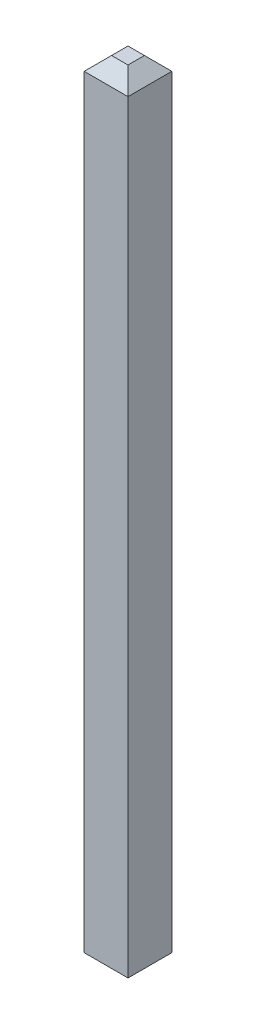
ISO-10303-21;
HEADER;
FILE_DESCRIPTION(('STEP AP214'),'2;1');
FILE_NAME('part.step','',(''),(''),'','','');
FILE_SCHEMA(('AUTOMOTIVE_DESIGN { 1 0 10303 214 1 1 1 1 }'));
ENDSEC;
DATA;
#1=APPLICATION_CONTEXT('core data for automotive mechanical design processes');
#2=APPLICATION_PROTOCOL_DEFINITION('international standard','automotive_design',2000,#1);
#3=PRODUCT_CONTEXT('',#1,'mechanical');
#4=PRODUCT('Part','Part','',(#3));
#5=PRODUCT_RELATED_PRODUCT_CATEGORY('part','',(#4));
#6=PRODUCT_DEFINITION_FORMATION('','',#4);
#7=PRODUCT_DEFINITION_CONTEXT('part definition',#1,'design');
#8=PRODUCT_DEFINITION('design','',#6,#7);
#9=PRODUCT_DEFINITION_SHAPE('','',#8);
#10=(LENGTH_UNIT() NAMED_UNIT(*) SI_UNIT(.MILLI.,.METRE.));
#11=(NAMED_UNIT(*) PLANE_ANGLE_UNIT() SI_UNIT($,.RADIAN.));
#12=(NAMED_UNIT(*) SI_UNIT($,.STERADIAN.) SOLID_ANGLE_UNIT());
#13=UNCERTAINTY_MEASURE_WITH_UNIT(LENGTH_MEASURE(1.E-05),#10,'distance_accuracy_value','');
#14=(GEOMETRIC_REPRESENTATION_CONTEXT(3) GLOBAL_UNCERTAINTY_ASSIGNED_CONTEXT((#13)) GLOBAL_UNIT_ASSIGNED_CONTEXT((#10,
#11,#12)) REPRESENTATION_CONTEXT('',''));
#15=CARTESIAN_POINT('',(0.,0.,0.));
#16=DIRECTION('',(0.,0.,1.));
#17=DIRECTION('',(1.,0.,0.));
#18=AXIS2_PLACEMENT_3D('',#15,#16,#17);
#19=CARTESIAN_POINT('',(-3.49,7.07,-0.32));
#20=DIRECTION('',(-0.707106781186548,-0.707106781186548,0.));
#21=DIRECTION('',(-0.707106781186548,0.707106781186548,0.));
#22=AXIS2_PLACEMENT_3D('',#19,#20,#21);
#23=PLANE('',#22);
#24=DIRECTION('',(0.577350269189626,-0.577350269189626,0.577350269189626));
#25=VECTOR('',#24,1.);
#26=CARTESIAN_POINT('',(-3.703333333333,7.283333333333,0.106666666667));
#27=LINE('',#26,#25);
#28=CARTESIAN_POINT('',(-3.69,7.27,0.12));
#29=VERTEX_POINT('',#28);
#30=CARTESIAN_POINT('',(-3.49,7.07,0.32));
#31=VERTEX_POINT('',#30);
#32=EDGE_CURVE('E92',#29,#31,#27,.T.);
#33=ORIENTED_EDGE('',*,*,#32,.T.);
#34=DIRECTION('',(0.,0.,1.));
#35=VECTOR('',#34,1.);
#36=CARTESIAN_POINT('',(-3.49,7.07,-0.32));
#37=LINE('',#36,#35);
#38=CARTESIAN_POINT('',(-3.49,7.07,-0.32));
#39=VERTEX_POINT('',#38);
#40=EDGE_CURVE('E95',#39,#31,#37,.T.);
#41=ORIENTED_EDGE('',*,*,#40,.F.);
#42=DIRECTION('',(0.577350269189626,-0.577350269189626,-0.577350269189626));
#43=VECTOR('',#42,1.);
#44=CARTESIAN_POINT('',(-3.49,7.07,-0.32));
#45=LINE('',#44,#43);
#46=CARTESIAN_POINT('',(-3.69,7.27,-0.12));
#47=VERTEX_POINT('',#46);
#48=EDGE_CURVE('E11',#47,#39,#45,.T.);
#49=ORIENTED_EDGE('',*,*,#48,.F.);
#50=DIRECTION('',(0.,0.,-1.));
#51=VECTOR('',#50,1.);
#52=CARTESIAN_POINT('',(-3.69,7.27,-0.32));
#53=LINE('',#52,#51);
#54=EDGE_CURVE('E98',#29,#47,#53,.T.);
#55=ORIENTED_EDGE('',*,*,#54,.F.);
#56=EDGE_LOOP('',(#33,#41,#49,#55));
#57=FACE_BOUND('',#56,.T.);
#58=ADVANCED_FACE('F17',(#57),#23,.F.);
#59=CARTESIAN_POINT('',(-3.81,7.07,-0.32));
#60=DIRECTION('',(0.,0.707106781186548,-0.707106781186548));
#61=DIRECTION('',(-1.,0.,0.));
#62=AXIS2_PLACEMENT_3D('',#59,#60,#61);
#63=PLANE('',#62);
#64=DIRECTION('',(0.577350269189626,0.577350269189626,0.577350269189626));
#65=VECTOR('',#64,1.);
#66=CARTESIAN_POINT('',(-3.996666666667,7.203333333333,-0.186666666667));
#67=LINE('',#66,#65);
#68=CARTESIAN_POINT('',(-4.13,7.07,-0.32));
#69=VERTEX_POINT('',#68);
#70=CARTESIAN_POINT('',(-3.93,7.27,-0.12));
#71=VERTEX_POINT('',#70);
#72=EDGE_CURVE('E26',#69,#71,#67,.T.);
#73=ORIENTED_EDGE('',*,*,#72,.T.);
#74=DIRECTION('',(-1.,0.,0.));
#75=VECTOR('',#74,1.);
#76=CARTESIAN_POINT('',(-4.13,7.27,-0.12));
#77=LINE('',#76,#75);
#78=EDGE_CURVE('E139',#47,#71,#77,.T.);
#79=ORIENTED_EDGE('',*,*,#78,.F.);
#80=ORIENTED_EDGE('',*,*,#48,.T.);
#81=DIRECTION('',(1.,0.,0.));
#82=VECTOR('',#81,1.);
#83=CARTESIAN_POINT('',(-3.49,7.07,-0.32));
#84=LINE('',#83,#82);
#85=EDGE_CURVE('E156',#69,#39,#84,.T.);
#86=ORIENTED_EDGE('',*,*,#85,.F.);
#87=EDGE_LOOP('',(#73,#79,#80,#86));
#88=FACE_BOUND('',#87,.T.);
#89=ADVANCED_FACE('F155',(#88),#63,.T.);
#90=CARTESIAN_POINT('',(-3.93,7.27,-0.32));
#91=DIRECTION('',(0.707106781186548,-0.707106781186548,0.));
#92=DIRECTION('',(0.,0.,-1.));
#93=AXIS2_PLACEMENT_3D('',#90,#91,#92);
#94=PLANE('',#93);
#95=DIRECTION('',(-0.577350269189626,-0.577350269189626,0.577350269189626));
#96=VECTOR('',#95,1.);
#97=CARTESIAN_POINT('',(-3.996666666667,7.203333333333,0.186666666667));
#98=LINE('',#97,#96);
#99=CARTESIAN_POINT('',(-3.93,7.27,0.12));
#100=VERTEX_POINT('',#99);
#101=CARTESIAN_POINT('',(-4.13,7.07,0.32));
#102=VERTEX_POINT('',#101);
#103=EDGE_CURVE('E39',#100,#102,#98,.T.);
#104=ORIENTED_EDGE('',*,*,#103,.F.);
#105=DIRECTION('',(0.,0.,1.));
#106=VECTOR('',#105,1.);
#107=CARTESIAN_POINT('',(-3.93,7.27,-0.32));
#108=LINE('',#107,#106);
#109=EDGE_CURVE('E143',#71,#100,#108,.T.);
#110=ORIENTED_EDGE('',*,*,#109,.F.);
#111=ORIENTED_EDGE('',*,*,#72,.F.);
#112=DIRECTION('',(0.,0.,-1.));
#113=VECTOR('',#112,1.);
#114=CARTESIAN_POINT('',(-4.13,7.07,-0.32));
#115=LINE('',#114,#113);
#116=EDGE_CURVE('E277',#102,#69,#115,.T.);
#117=ORIENTED_EDGE('',*,*,#116,.F.);
#118=EDGE_LOOP('',(#104,#110,#111,#117));
#119=FACE_BOUND('',#118,.T.);
#120=ADVANCED_FACE('F159',(#119),#94,.F.);
#121=CARTESIAN_POINT('',(-4.13,7.27,0.12));
#122=DIRECTION('',(0.,-0.707106781186548,-0.707106781186548));
#123=DIRECTION('',(0.,-0.707106781186548,0.707106781186548));
#124=AXIS2_PLACEMENT_3D('',#121,#122,#123);
#125=PLANE('',#124);
#126=ORIENTED_EDGE('',*,*,#32,.F.);
#127=DIRECTION('',(1.,0.,0.));
#128=VECTOR('',#127,1.);
#129=CARTESIAN_POINT('',(-4.13,7.27,0.12));
#130=LINE('',#129,#128);
#131=EDGE_CURVE('E103',#100,#29,#130,.T.);
#132=ORIENTED_EDGE('',*,*,#131,.F.);
#133=ORIENTED_EDGE('',*,*,#103,.T.);
#134=DIRECTION('',(-1.,0.,0.));
#135=VECTOR('',#134,1.);
#136=CARTESIAN_POINT('',(-3.81,7.07,0.32));
#137=LINE('',#136,#135);
#138=EDGE_CURVE('E114',#31,#102,#137,.T.);
#139=ORIENTED_EDGE('',*,*,#138,.F.);
#140=EDGE_LOOP('',(#126,#132,#133,#139));
#141=FACE_BOUND('',#140,.T.);
#142=ADVANCED_FACE('F117',(#141),#125,.F.);
#143=CARTESIAN_POINT('',(-4.13,7.27,-0.32));
#144=DIRECTION('',(0.,-1.,0.));
#145=DIRECTION('',(0.,0.,-1.));
#146=AXIS2_PLACEMENT_3D('',#143,#144,#145);
#147=PLANE('',#146);
#148=ORIENTED_EDGE('',*,*,#54,.T.);
#149=ORIENTED_EDGE('',*,*,#78,.T.);
#150=ORIENTED_EDGE('',*,*,#109,.T.);
#151=ORIENTED_EDGE('',*,*,#131,.T.);
#152=EDGE_LOOP('',(#148,#149,#150,#151));
#153=FACE_BOUND('',#152,.T.);
#154=ADVANCED_FACE('F161',(#153),#147,.F.);
#155=CARTESIAN_POINT('',(-3.49,7.27,-0.32));
#156=DIRECTION('',(-1.,0.,0.));
#157=DIRECTION('',(0.,1.,0.));
#158=AXIS2_PLACEMENT_3D('',#155,#156,#157);
#159=PLANE('',#158);
#160=DIRECTION('',(0.,-1.,0.));
#161=VECTOR('',#160,1.);
#162=CARTESIAN_POINT('',(-3.49,7.27,-0.32));
#163=LINE('',#162,#161);
#164=CARTESIAN_POINT('',(-3.49,-4.07,-0.32));
#165=VERTEX_POINT('',#164);
#166=EDGE_CURVE('E111',#39,#165,#163,.T.);
#167=ORIENTED_EDGE('',*,*,#166,.F.);
#168=ORIENTED_EDGE('',*,*,#40,.T.);
#169=DIRECTION('',(0.,-1.,0.));
#170=VECTOR('',#169,1.);
#171=CARTESIAN_POINT('',(-3.49,7.27,0.32));
#172=LINE('',#171,#170);
#173=CARTESIAN_POINT('',(-3.49,-4.07,0.32));
#174=VERTEX_POINT('',#173);
#175=EDGE_CURVE('E108',#31,#174,#172,.T.);
#176=ORIENTED_EDGE('',*,*,#175,.T.);
#177=DIRECTION('',(0.,0.,-1.));
#178=VECTOR('',#177,1.);
#179=CARTESIAN_POINT('',(-3.49,-4.07,-0.32));
#180=LINE('',#179,#178);
#181=EDGE_CURVE('E127',#174,#165,#180,.T.);
#182=ORIENTED_EDGE('',*,*,#181,.T.);
#183=EDGE_LOOP('',(#167,#168,#176,#182));
#184=FACE_BOUND('',#183,.T.);
#185=ADVANCED_FACE('F106',(#184),#159,.F.);
#186=CARTESIAN_POINT('',(-3.81,1.5,0.32));
#187=DIRECTION('',(0.,0.,-1.));
#188=DIRECTION('',(0.,-1.,0.));
#189=AXIS2_PLACEMENT_3D('',#186,#187,#188);
#190=PLANE('',#189);
#191=ORIENTED_EDGE('',*,*,#175,.F.);
#192=ORIENTED_EDGE('',*,*,#138,.T.);
#193=DIRECTION('',(0.,1.,0.));
#194=VECTOR('',#193,1.);
#195=CARTESIAN_POINT('',(-4.13,-4.27,0.32));
#196=LINE('',#195,#194);
#197=CARTESIAN_POINT('',(-4.13,-4.07,0.32));
#198=VERTEX_POINT('',#197);
#199=EDGE_CURVE('E273',#198,#102,#196,.T.);
#200=ORIENTED_EDGE('',*,*,#199,.F.);
#201=DIRECTION('',(1.,0.,0.));
#202=VECTOR('',#201,1.);
#203=CARTESIAN_POINT('',(-3.81,-4.07,0.32));
#204=LINE('',#203,#202);
#205=EDGE_CURVE('E124',#198,#174,#204,.T.);
#206=ORIENTED_EDGE('',*,*,#205,.T.);
#207=EDGE_LOOP('',(#191,#192,#200,#206));
#208=FACE_BOUND('',#207,.T.);
#209=ADVANCED_FACE('F123',(#208),#190,.F.);
#210=CARTESIAN_POINT('',(-3.69,-4.27,-0.32));
#211=DIRECTION('',(-0.707106781186548,0.707106781186548,0.));
#212=DIRECTION('',(0.,0.,1.));
#213=AXIS2_PLACEMENT_3D('',#210,#211,#212);
#214=PLANE('',#213);
#215=DIRECTION('',(-0.577350269189626,-0.577350269189626,0.577350269189626));
#216=VECTOR('',#215,1.);
#217=CARTESIAN_POINT('',(-3.623333333333,-4.203333333333,-0.186666666667));
#218=LINE('',#217,#216);
#219=CARTESIAN_POINT('',(-3.69,-4.27,-0.12));
#220=VERTEX_POINT('',#219);
#221=EDGE_CURVE('E239',#165,#220,#218,.T.);
#222=ORIENTED_EDGE('',*,*,#221,.F.);
#223=ORIENTED_EDGE('',*,*,#181,.F.);
#224=DIRECTION('',(-0.577350269189626,-0.577350269189626,-0.577350269189626));
#225=VECTOR('',#224,1.);
#226=CARTESIAN_POINT('',(-3.836666666667,-4.416666666667,-0.02666666666667));
#227=LINE('',#226,#225);
#228=CARTESIAN_POINT('',(-3.69,-4.27,0.12));
#229=VERTEX_POINT('',#228);
#230=EDGE_CURVE('E268',#174,#229,#227,.T.);
#231=ORIENTED_EDGE('',*,*,#230,.T.);
#232=DIRECTION('',(0.,0.,1.));
#233=VECTOR('',#232,1.);
#234=CARTESIAN_POINT('',(-3.69,-4.27,-0.32));
#235=LINE('',#234,#233);
#236=EDGE_CURVE('E244',#220,#229,#235,.T.);
#237=ORIENTED_EDGE('',*,*,#236,.F.);
#238=EDGE_LOOP('',(#222,#223,#231,#237));
#239=FACE_BOUND('',#238,.T.);
#240=ADVANCED_FACE('F223',(#239),#214,.F.);
#241=CARTESIAN_POINT('',(-3.49,-4.27,0.12));
#242=DIRECTION('',(0.,0.707106781186548,-0.707106781186548));
#243=DIRECTION('',(-1.,0.,0.));
#244=AXIS2_PLACEMENT_3D('',#241,#242,#243);
#245=PLANE('',#244);
#246=ORIENTED_EDGE('',*,*,#230,.F.);
#247=ORIENTED_EDGE('',*,*,#205,.F.);
#248=DIRECTION('',(-0.577350269189626,0.577350269189626,0.577350269189626));
#249=VECTOR('',#248,1.);
#250=CARTESIAN_POINT('',(-3.916666666667,-4.283333333333,0.106666666667));
#251=LINE('',#250,#249);
#252=CARTESIAN_POINT('',(-3.93,-4.27,0.12));
#253=VERTEX_POINT('',#252);
#254=EDGE_CURVE('E134',#253,#198,#251,.T.);
#255=ORIENTED_EDGE('',*,*,#254,.F.);
#256=DIRECTION('',(-1.,0.,0.));
#257=VECTOR('',#256,1.);
#258=CARTESIAN_POINT('',(-3.49,-4.27,0.12));
#259=LINE('',#258,#257);
#260=EDGE_CURVE('E294',#229,#253,#259,.T.);
#261=ORIENTED_EDGE('',*,*,#260,.F.);
#262=EDGE_LOOP('',(#246,#247,#255,#261));
#263=FACE_BOUND('',#262,.T.);
#264=ADVANCED_FACE('F229',(#263),#245,.F.);
#265=CARTESIAN_POINT('',(-4.13,-4.07,-0.32));
#266=DIRECTION('',(0.707106781186548,0.707106781186548,0.));
#267=DIRECTION('',(0.,0.,-1.));
#268=AXIS2_PLACEMENT_3D('',#265,#266,#267);
#269=PLANE('',#268);
#270=DIRECTION('',(0.577350269189626,-0.577350269189626,0.577350269189626));
#271=VECTOR('',#270,1.);
#272=CARTESIAN_POINT('',(-4.023333333333,-4.176666666667,-0.213333333333));
#273=LINE('',#272,#271);
#274=CARTESIAN_POINT('',(-4.13,-4.07,-0.32));
#275=VERTEX_POINT('',#274);
#276=CARTESIAN_POINT('',(-3.93,-4.27,-0.12));
#277=VERTEX_POINT('',#276);
#278=EDGE_CURVE('E255',#275,#277,#273,.T.);
#279=ORIENTED_EDGE('',*,*,#278,.T.);
#280=DIRECTION('',(0.,0.,-1.));
#281=VECTOR('',#280,1.);
#282=CARTESIAN_POINT('',(-3.93,-4.27,-0.32));
#283=LINE('',#282,#281);
#284=EDGE_CURVE('E290',#253,#277,#283,.T.);
#285=ORIENTED_EDGE('',*,*,#284,.F.);
#286=ORIENTED_EDGE('',*,*,#254,.T.);
#287=DIRECTION('',(0.,0.,1.));
#288=VECTOR('',#287,1.);
#289=CARTESIAN_POINT('',(-4.13,-4.07,-0.32));
#290=LINE('',#289,#288);
#291=EDGE_CURVE('E278',#275,#198,#290,.T.);
#292=ORIENTED_EDGE('',*,*,#291,.F.);
#293=EDGE_LOOP('',(#279,#285,#286,#292));
#294=FACE_BOUND('',#293,.T.);
#295=ADVANCED_FACE('F234',(#294),#269,.F.);
#296=CARTESIAN_POINT('',(-4.13,-4.27,-0.32));
#297=DIRECTION('',(1.,0.,0.));
#298=DIRECTION('',(0.,0.,1.));
#299=AXIS2_PLACEMENT_3D('',#296,#297,#298);
#300=PLANE('',#299);
#301=ORIENTED_EDGE('',*,*,#199,.T.);
#302=ORIENTED_EDGE('',*,*,#116,.T.);
#303=DIRECTION('',(0.,1.,0.));
#304=VECTOR('',#303,1.);
#305=CARTESIAN_POINT('',(-4.13,-4.27,-0.32));
#306=LINE('',#305,#304);
#307=EDGE_CURVE('E249',#275,#69,#306,.T.);
#308=ORIENTED_EDGE('',*,*,#307,.F.);
#309=ORIENTED_EDGE('',*,*,#291,.T.);
#310=EDGE_LOOP('',(#301,#302,#308,#309));
#311=FACE_BOUND('',#310,.T.);
#312=ADVANCED_FACE('F285',(#311),#300,.F.);
#313=CARTESIAN_POINT('',(-3.81,1.5,-0.32));
#314=DIRECTION('',(0.,0.,-1.));
#315=DIRECTION('',(0.,-1.,0.));
#316=AXIS2_PLACEMENT_3D('',#313,#314,#315);
#317=PLANE('',#316);
#318=ORIENTED_EDGE('',*,*,#307,.T.);
#319=ORIENTED_EDGE('',*,*,#85,.T.);
#320=ORIENTED_EDGE('',*,*,#166,.T.);
#321=DIRECTION('',(-1.,0.,0.));
#322=VECTOR('',#321,1.);
#323=CARTESIAN_POINT('',(-4.13,-4.07,-0.32));
#324=LINE('',#323,#322);
#325=EDGE_CURVE('E250',#165,#275,#324,.T.);
#326=ORIENTED_EDGE('',*,*,#325,.T.);
#327=EDGE_LOOP('',(#318,#319,#320,#326));
#328=FACE_BOUND('',#327,.T.);
#329=ADVANCED_FACE('F391',(#328),#317,.T.);
#330=CARTESIAN_POINT('',(-3.81,-4.07,-0.32));
#331=DIRECTION('',(0.,-0.707106781186548,-0.707106781186548));
#332=DIRECTION('',(0.,-0.707106781186548,0.707106781186548));
#333=AXIS2_PLACEMENT_3D('',#330,#331,#332);
#334=PLANE('',#333);
#335=ORIENTED_EDGE('',*,*,#278,.F.);
#336=ORIENTED_EDGE('',*,*,#325,.F.);
#337=ORIENTED_EDGE('',*,*,#221,.T.);
#338=DIRECTION('',(1.,0.,0.));
#339=VECTOR('',#338,1.);
#340=CARTESIAN_POINT('',(-3.49,-4.27,-0.12));
#341=LINE('',#340,#339);
#342=EDGE_CURVE('E262',#277,#220,#341,.T.);
#343=ORIENTED_EDGE('',*,*,#342,.F.);
#344=EDGE_LOOP('',(#335,#336,#337,#343));
#345=FACE_BOUND('',#344,.T.);
#346=ADVANCED_FACE('F254',(#345),#334,.T.);
#347=CARTESIAN_POINT('',(-3.49,-4.27,-0.32));
#348=DIRECTION('',(0.,1.,0.));
#349=DIRECTION('',(0.,0.,-1.));
#350=AXIS2_PLACEMENT_3D('',#347,#348,#349);
#351=PLANE('',#350);
#352=ORIENTED_EDGE('',*,*,#236,.T.);
#353=ORIENTED_EDGE('',*,*,#260,.T.);
#354=ORIENTED_EDGE('',*,*,#284,.T.);
#355=ORIENTED_EDGE('',*,*,#342,.T.);
#356=EDGE_LOOP('',(#352,#353,#354,#355));
#357=FACE_BOUND('',#356,.T.);
#358=ADVANCED_FACE('F313',(#357),#351,.F.);
#359=CLOSED_SHELL('',(#58,#89,#120,#142,#154,#185,#209,#240,#264,#295,#312,#329,#346,#358));
#360=MANIFOLD_SOLID_BREP('B1',#359);
#361=ADVANCED_BREP_SHAPE_REPRESENTATION('',(#18,#360),#14);
#362=SHAPE_DEFINITION_REPRESENTATION(#9,#361);
ENDSEC;
END-ISO-10303-21;
